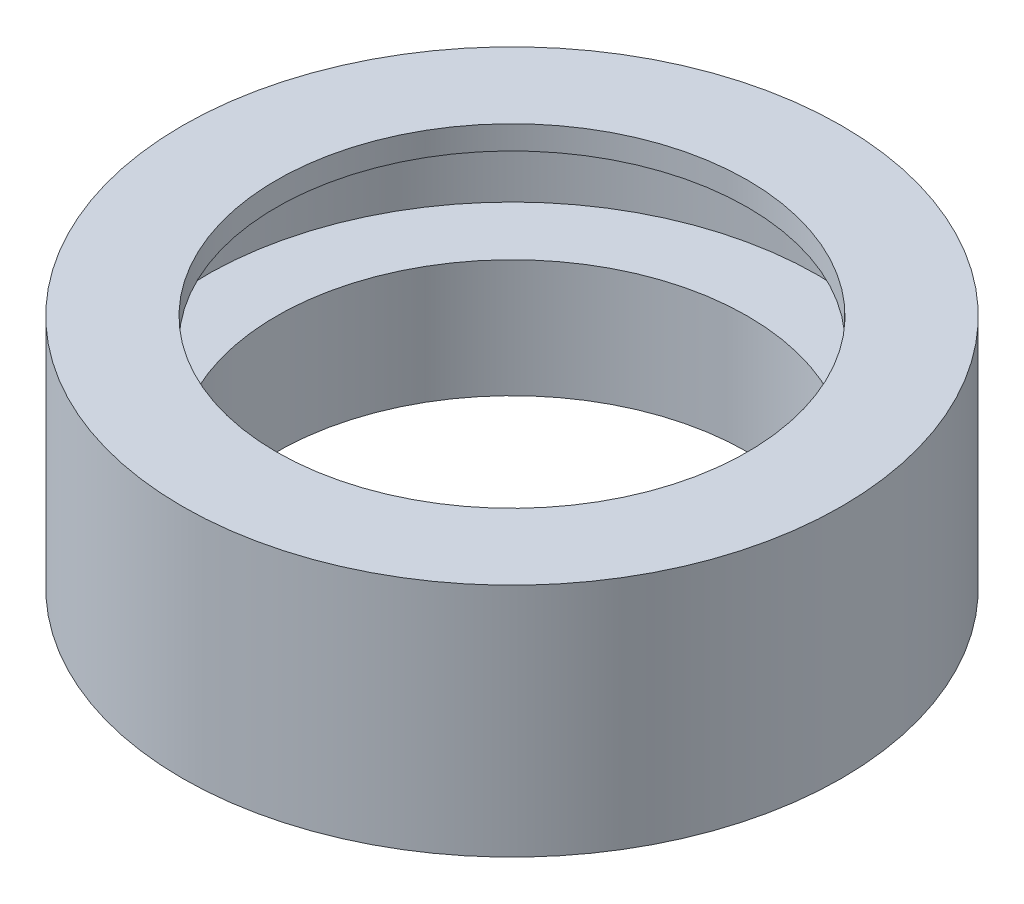
ISO-10303-21;
HEADER;
FILE_DESCRIPTION(('STEP AP214'),'2;1');
FILE_NAME('part.step','',(''),(''),'','','');
FILE_SCHEMA(('AUTOMOTIVE_DESIGN { 1 0 10303 214 1 1 1 1 }'));
ENDSEC;
DATA;
#1=APPLICATION_CONTEXT('core data for automotive mechanical design processes');
#2=APPLICATION_PROTOCOL_DEFINITION('international standard','automotive_design',2000,#1);
#3=PRODUCT_CONTEXT('',#1,'mechanical');
#4=PRODUCT('Part','Part','',(#3));
#5=PRODUCT_RELATED_PRODUCT_CATEGORY('part','',(#4));
#6=PRODUCT_DEFINITION_FORMATION('','',#4);
#7=PRODUCT_DEFINITION_CONTEXT('part definition',#1,'design');
#8=PRODUCT_DEFINITION('design','',#6,#7);
#9=PRODUCT_DEFINITION_SHAPE('','',#8);
#10=(LENGTH_UNIT() NAMED_UNIT(*) SI_UNIT(.MILLI.,.METRE.));
#11=(NAMED_UNIT(*) PLANE_ANGLE_UNIT() SI_UNIT($,.RADIAN.));
#12=(NAMED_UNIT(*) SI_UNIT($,.STERADIAN.) SOLID_ANGLE_UNIT());
#13=UNCERTAINTY_MEASURE_WITH_UNIT(LENGTH_MEASURE(1.E-05),#10,'distance_accuracy_value','');
#14=(GEOMETRIC_REPRESENTATION_CONTEXT(3) GLOBAL_UNCERTAINTY_ASSIGNED_CONTEXT((#13)) GLOBAL_UNIT_ASSIGNED_CONTEXT((#10,
#11,#12)) REPRESENTATION_CONTEXT('',''));
#15=CARTESIAN_POINT('',(0.,0.,0.));
#16=DIRECTION('',(0.,0.,1.));
#17=DIRECTION('',(1.,0.,0.));
#18=AXIS2_PLACEMENT_3D('',#15,#16,#17);
#19=CARTESIAN_POINT('',(0.,0.,0.));
#20=DIRECTION('',(0.,-1.,0.));
#21=DIRECTION('',(0.,0.,-1.));
#22=AXIS2_PLACEMENT_3D('',#19,#20,#21);
#23=CYLINDRICAL_SURFACE('',#22,5.);
#24=CARTESIAN_POINT('',(0.,8.21160093642082,0.));
#25=DIRECTION('',(0.,-1.,0.));
#26=DIRECTION('',(0.,0.,-1.));
#27=AXIS2_PLACEMENT_3D('',#24,#25,#26);
#28=CIRCLE('',#27,5.);
#29=CARTESIAN_POINT('',(0.,8.21160093642082,-5.));
#30=VERTEX_POINT('',#29);
#31=EDGE_CURVE('E49',#30,#30,#28,.T.);
#32=ORIENTED_EDGE('',*,*,#31,.T.);
#33=EDGE_LOOP('',(#32));
#34=FACE_BOUND('',#33,.T.);
#35=CARTESIAN_POINT('',(0.,8.71160093642082,0.));
#36=DIRECTION('',(0.,1.,0.));
#37=DIRECTION('',(0.,0.,1.));
#38=AXIS2_PLACEMENT_3D('',#35,#36,#37);
#39=CIRCLE('',#38,5.);
#40=CARTESIAN_POINT('',(0.,8.71160093642082,5.));
#41=VERTEX_POINT('',#40);
#42=EDGE_CURVE('E60',#41,#41,#39,.F.);
#43=ORIENTED_EDGE('',*,*,#42,.F.);
#44=EDGE_LOOP('',(#43));
#45=FACE_BOUND('',#44,.T.);
#46=ADVANCED_FACE('F34',(#34,#45),#23,.F.);
#47=CARTESIAN_POINT('',(0.,0.,0.));
#48=DIRECTION('',(0.,-1.,0.));
#49=DIRECTION('',(0.,0.,-1.));
#50=AXIS2_PLACEMENT_3D('',#47,#48,#49);
#51=CYLINDRICAL_SURFACE('',#50,7.);
#52=CARTESIAN_POINT('',(0.,3.71160093642082,0.));
#53=DIRECTION('',(0.,-1.,0.));
#54=DIRECTION('',(0.,0.,-1.));
#55=AXIS2_PLACEMENT_3D('',#52,#53,#54);
#56=CIRCLE('',#55,7.);
#57=CARTESIAN_POINT('',(0.,3.71160093642082,-7.));
#58=VERTEX_POINT('',#57);
#59=EDGE_CURVE('E54',#58,#58,#56,.T.);
#60=ORIENTED_EDGE('',*,*,#59,.F.);
#61=EDGE_LOOP('',(#60));
#62=FACE_BOUND('',#61,.T.);
#63=CARTESIAN_POINT('',(0.,8.71160093642082,0.));
#64=DIRECTION('',(0.,1.,0.));
#65=DIRECTION('',(0.,0.,1.));
#66=AXIS2_PLACEMENT_3D('',#63,#64,#65);
#67=CIRCLE('',#66,7.);
#68=CARTESIAN_POINT('',(0.,8.71160093642082,7.));
#69=VERTEX_POINT('',#68);
#70=EDGE_CURVE('E63',#69,#69,#67,.T.);
#71=ORIENTED_EDGE('',*,*,#70,.F.);
#72=EDGE_LOOP('',(#71));
#73=FACE_BOUND('',#72,.T.);
#74=ADVANCED_FACE('F70',(#62,#73),#51,.T.);
#75=CARTESIAN_POINT('',(0.,0.,0.));
#76=DIRECTION('',(0.,-1.,0.));
#77=DIRECTION('',(0.,0.,-1.));
#78=AXIS2_PLACEMENT_3D('',#75,#76,#77);
#79=CYLINDRICAL_SURFACE('',#78,5.);
#80=CARTESIAN_POINT('',(0.,6.21160093642082,0.));
#81=DIRECTION('',(0.,-1.,0.));
#82=DIRECTION('',(0.,0.,-1.));
#83=AXIS2_PLACEMENT_3D('',#80,#81,#82);
#84=CIRCLE('',#83,5.);
#85=CARTESIAN_POINT('',(0.,6.21160093642082,-5.));
#86=VERTEX_POINT('',#85);
#87=EDGE_CURVE('E10',#86,#86,#84,.T.);
#88=ORIENTED_EDGE('',*,*,#87,.F.);
#89=EDGE_LOOP('',(#88));
#90=FACE_BOUND('',#89,.T.);
#91=CARTESIAN_POINT('',(0.,3.71160093642082,0.));
#92=DIRECTION('',(0.,-1.,0.));
#93=DIRECTION('',(0.,0.,-1.));
#94=AXIS2_PLACEMENT_3D('',#91,#92,#93);
#95=CIRCLE('',#94,5.);
#96=CARTESIAN_POINT('',(0.,3.71160093642082,-5.));
#97=VERTEX_POINT('',#96);
#98=EDGE_CURVE('E57',#97,#97,#95,.T.);
#99=ORIENTED_EDGE('',*,*,#98,.T.);
#100=EDGE_LOOP('',(#99));
#101=FACE_BOUND('',#100,.T.);
#102=ADVANCED_FACE('F36',(#90,#101),#79,.F.);
#103=CARTESIAN_POINT('',(0.,6.21160093642082,-5.));
#104=DIRECTION('',(0.,-1.,0.));
#105=DIRECTION('',(0.,0.,-1.));
#106=AXIS2_PLACEMENT_3D('',#103,#104,#105);
#107=PLANE('',#106);
#108=CARTESIAN_POINT('',(0.,6.21160093642082,0.));
#109=DIRECTION('',(0.,-1.,0.));
#110=DIRECTION('',(0.,0.,-1.));
#111=AXIS2_PLACEMENT_3D('',#108,#109,#110);
#112=CIRCLE('',#111,6.5);
#113=CARTESIAN_POINT('',(0.,6.21160093642082,-6.5));
#114=VERTEX_POINT('',#113);
#115=EDGE_CURVE('E41',#114,#114,#112,.T.);
#116=ORIENTED_EDGE('',*,*,#115,.F.);
#117=EDGE_LOOP('',(#116));
#118=FACE_BOUND('',#117,.T.);
#119=ORIENTED_EDGE('',*,*,#87,.T.);
#120=EDGE_LOOP('',(#119));
#121=FACE_BOUND('',#120,.T.);
#122=ADVANCED_FACE('F78',(#118,#121),#107,.F.);
#123=CARTESIAN_POINT('',(0.,0.,0.));
#124=DIRECTION('',(0.,-1.,0.));
#125=DIRECTION('',(0.,0.,-1.));
#126=AXIS2_PLACEMENT_3D('',#123,#124,#125);
#127=CYLINDRICAL_SURFACE('',#126,6.5);
#128=CARTESIAN_POINT('',(0.,8.21160093642082,0.));
#129=DIRECTION('',(0.,-1.,0.));
#130=DIRECTION('',(0.,0.,-1.));
#131=AXIS2_PLACEMENT_3D('',#128,#129,#130);
#132=CIRCLE('',#131,6.5);
#133=CARTESIAN_POINT('',(0.,8.21160093642082,-6.5));
#134=VERTEX_POINT('',#133);
#135=EDGE_CURVE('E45',#134,#134,#132,.T.);
#136=ORIENTED_EDGE('',*,*,#135,.F.);
#137=EDGE_LOOP('',(#136));
#138=FACE_BOUND('',#137,.T.);
#139=ORIENTED_EDGE('',*,*,#115,.T.);
#140=EDGE_LOOP('',(#139));
#141=FACE_BOUND('',#140,.T.);
#142=ADVANCED_FACE('F90',(#138,#141),#127,.F.);
#143=CARTESIAN_POINT('',(0.,8.21160093642082,-6.5));
#144=DIRECTION('',(0.,1.,0.));
#145=DIRECTION('',(0.,0.,1.));
#146=AXIS2_PLACEMENT_3D('',#143,#144,#145);
#147=PLANE('',#146);
#148=ORIENTED_EDGE('',*,*,#31,.F.);
#149=EDGE_LOOP('',(#148));
#150=FACE_BOUND('',#149,.T.);
#151=ORIENTED_EDGE('',*,*,#135,.T.);
#152=EDGE_LOOP('',(#151));
#153=FACE_BOUND('',#152,.T.);
#154=ADVANCED_FACE('F87',(#150,#153),#147,.F.);
#155=CARTESIAN_POINT('',(0.,3.71160093642082,-5.));
#156=DIRECTION('',(0.,-1.,0.));
#157=DIRECTION('',(0.,0.,-1.));
#158=AXIS2_PLACEMENT_3D('',#155,#156,#157);
#159=PLANE('',#158);
#160=ORIENTED_EDGE('',*,*,#59,.T.);
#161=EDGE_LOOP('',(#160));
#162=FACE_BOUND('',#161,.T.);
#163=ORIENTED_EDGE('',*,*,#98,.F.);
#164=EDGE_LOOP('',(#163));
#165=FACE_BOUND('',#164,.T.);
#166=ADVANCED_FACE('F84',(#162,#165),#159,.T.);
#167=CARTESIAN_POINT('',(0.,8.71160093642082,0.));
#168=DIRECTION('',(0.,1.,0.));
#169=DIRECTION('',(0.,0.,1.));
#170=AXIS2_PLACEMENT_3D('',#167,#168,#169);
#171=PLANE('',#170);
#172=ORIENTED_EDGE('',*,*,#70,.T.);
#173=EDGE_LOOP('',(#172));
#174=FACE_BOUND('',#173,.T.);
#175=ORIENTED_EDGE('',*,*,#42,.T.);
#176=EDGE_LOOP('',(#175));
#177=FACE_BOUND('',#176,.T.);
#178=ADVANCED_FACE('F67',(#174,#177),#171,.T.);
#179=CLOSED_SHELL('',(#46,#74,#102,#122,#142,#154,#166,#178));
#180=MANIFOLD_SOLID_BREP('B2',#179);
#181=ADVANCED_BREP_SHAPE_REPRESENTATION('',(#18,#180),#14);
#182=SHAPE_DEFINITION_REPRESENTATION(#9,#181);
ENDSEC;
END-ISO-10303-21;
